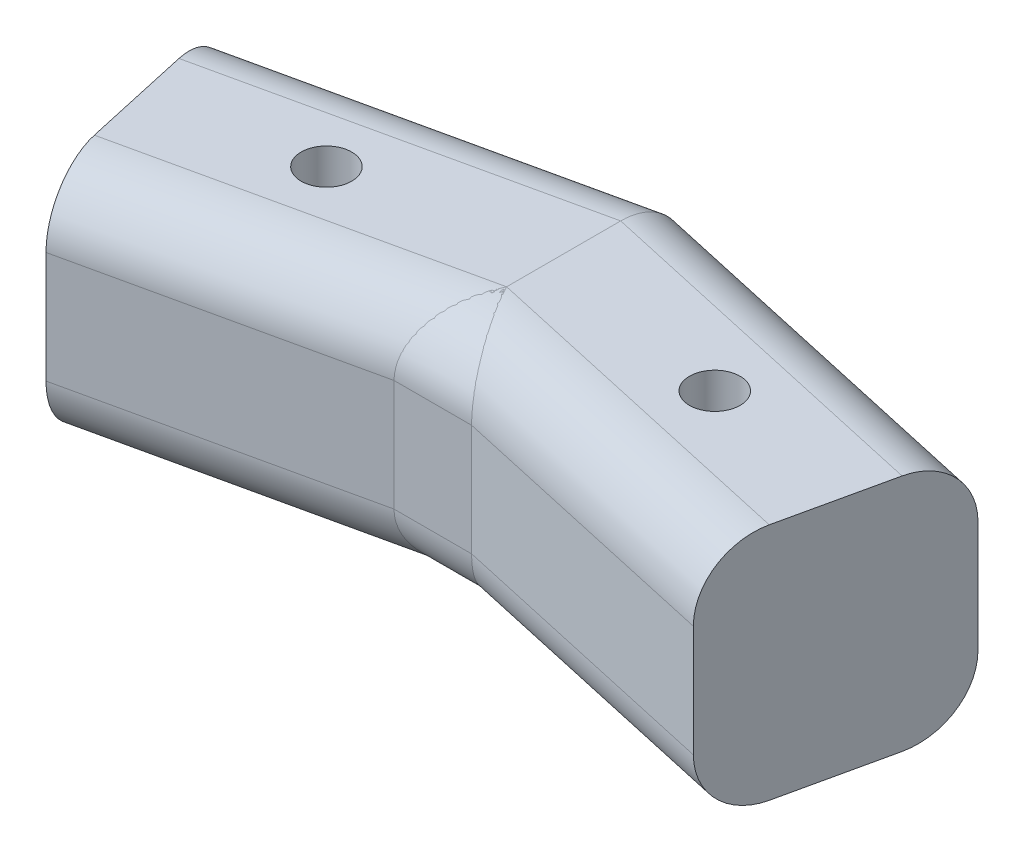
ISO-10303-21;
HEADER;
FILE_DESCRIPTION(('STEP AP214'),'2;1');
FILE_NAME('part.step','',(''),(''),'','','');
FILE_SCHEMA(('AUTOMOTIVE_DESIGN { 1 0 10303 214 1 1 1 1 }'));
ENDSEC;
DATA;
#1=APPLICATION_CONTEXT('core data for automotive mechanical design processes');
#2=APPLICATION_PROTOCOL_DEFINITION('international standard','automotive_design',2000,#1);
#3=PRODUCT_CONTEXT('',#1,'mechanical');
#4=PRODUCT('Part','Part','',(#3));
#5=PRODUCT_RELATED_PRODUCT_CATEGORY('part','',(#4));
#6=PRODUCT_DEFINITION_FORMATION('','',#4);
#7=PRODUCT_DEFINITION_CONTEXT('part definition',#1,'design');
#8=PRODUCT_DEFINITION('design','',#6,#7);
#9=PRODUCT_DEFINITION_SHAPE('','',#8);
#10=(LENGTH_UNIT() NAMED_UNIT(*) SI_UNIT(.MILLI.,.METRE.));
#11=(NAMED_UNIT(*) PLANE_ANGLE_UNIT() SI_UNIT($,.RADIAN.));
#12=(NAMED_UNIT(*) SI_UNIT($,.STERADIAN.) SOLID_ANGLE_UNIT());
#13=UNCERTAINTY_MEASURE_WITH_UNIT(LENGTH_MEASURE(1.E-05),#10,'distance_accuracy_value','');
#14=(GEOMETRIC_REPRESENTATION_CONTEXT(3) GLOBAL_UNCERTAINTY_ASSIGNED_CONTEXT((#13)) GLOBAL_UNIT_ASSIGNED_CONTEXT((#10,
#11,#12)) REPRESENTATION_CONTEXT('',''));
#15=CARTESIAN_POINT('',(0.,0.,0.));
#16=DIRECTION('',(0.,0.,1.));
#17=DIRECTION('',(1.,0.,0.));
#18=AXIS2_PLACEMENT_3D('',#15,#16,#17);
#19=CARTESIAN_POINT('',(0.,-9.525,4.55292244112799));
#20=CARTESIAN_POINT('',(-0.405791092922876,-9.52535412938452,5.32406036212419));
#21=CARTESIAN_POINT('',(-0.811316954403451,-9.39280386113973,6.09469425524347));
#22=CARTESIAN_POINT('',(-1.56112119510349,-8.88381218917494,7.5195714726382));
#23=CARTESIAN_POINT('',(-1.90490937707828,-8.50734945434817,8.17288325925607));
#24=CARTESIAN_POINT('',(-2.47878471987863,-7.56685544250716,9.26343710944152));
#25=CARTESIAN_POINT('',(-2.7084966189939,-7.00343920013842,9.69996605105997));
#26=CARTESIAN_POINT('',(-3.01907573743721,-5.7746244726909,10.2901695815911));
#27=CARTESIAN_POINT('',(-3.09995590704577,-5.1100296057156,10.4438687803402));
#28=CARTESIAN_POINT('',(-3.09973982260569,-4.445,10.4434581480992));
#29=CARTESIAN_POINT('',(0.,-9.525,4.55292244112802));
#30=CARTESIAN_POINT('',(0.405791092922976,-9.52535412938452,5.32406036212419));
#31=CARTESIAN_POINT('',(0.811316954403549,-9.39280386113972,6.09469425524349));
#32=CARTESIAN_POINT('',(1.56112119510361,-8.88381218917493,7.51957147263821));
#33=CARTESIAN_POINT('',(1.90490937707838,-8.50734945434815,8.17288325925609));
#34=CARTESIAN_POINT('',(2.47878471987874,-7.56685544250715,9.26343710944152));
#35=CARTESIAN_POINT('',(2.70849661899401,-7.00343920013841,9.69996605105997));
#36=CARTESIAN_POINT('',(3.01907573743732,-5.77462447269089,10.2901695815911));
#37=CARTESIAN_POINT('',(3.09995590704586,-5.1100296057156,10.4438687803402));
#38=CARTESIAN_POINT('',(3.0997398226058,-4.445,10.4434581480992));
#39=B_SPLINE_SURFACE_WITH_KNOTS('',1,3,((#19,#20,#21,#22,#23,#24,#25,#26,#27,#28),(#29,#30,#31,
#32,#33,#34,#35,#36,#37,#38)),.UNSPECIFIED.,.F.,.F.,.F.,(2,2),(4,2,2,2,4),(0.,1.),(0.,
0.392699081698724,0.785398163397448,1.17809724509617,1.57079632679489),.UNSPECIFIED.);
#40=CARTESIAN_POINT('',(-3.09973982260569,-4.445,10.4434581480992));
#41=CARTESIAN_POINT('',(-3.09995590704577,-5.1100296057156,10.4438687803402));
#42=CARTESIAN_POINT('',(-3.01907573743721,-5.7746244726909,10.2901695815911));
#43=CARTESIAN_POINT('',(-2.7084966189939,-7.00343920013842,9.69996605105997));
#44=CARTESIAN_POINT('',(-2.47878471987863,-7.56685544250716,9.26343710944152));
#45=CARTESIAN_POINT('',(-1.90490937707828,-8.50734945434817,8.17288325925607));
#46=CARTESIAN_POINT('',(-1.56112119510349,-8.88381218917494,7.5195714726382));
#47=CARTESIAN_POINT('',(-0.811316954403451,-9.39280386113973,6.09469425524347));
#48=CARTESIAN_POINT('',(-0.405791092922876,-9.52535412938452,5.32406036212419));
#49=CARTESIAN_POINT('',(0.,-9.525,4.55292244112799));
#50=B_SPLINE_CURVE_WITH_KNOTS('',3,(#40,#41,#42,#43,#44,#45,#46,#47,#48,#49),.UNSPECIFIED.,.F.,
.F.,(4,2,2,2,4),(0.,0.392699081698724,0.785398163397448,1.17809724509617,1.57079632679489),.UNSPECIFIED.);
#51=CARTESIAN_POINT('',(0.,-9.525,4.552922441128));
#52=VERTEX_POINT('',#51);
#53=CARTESIAN_POINT('',(-3.09973982260576,-4.445,10.4434581480992));
#54=VERTEX_POINT('',#53);
#55=EDGE_CURVE('E76',#52,#54,#50,.F.);
#56=CARTESIAN_POINT('',(0.,-9.525,4.55292244112802));
#57=CARTESIAN_POINT('',(0.405791092922976,-9.52535412938452,5.32406036212419));
#58=CARTESIAN_POINT('',(0.811316954403549,-9.39280386113972,6.09469425524349));
#59=CARTESIAN_POINT('',(1.56112119510361,-8.88381218917493,7.51957147263821));
#60=CARTESIAN_POINT('',(1.90490937707838,-8.50734945434815,8.17288325925609));
#61=CARTESIAN_POINT('',(2.47878471987874,-7.56685544250715,9.26343710944152));
#62=CARTESIAN_POINT('',(2.70849661899401,-7.00343920013841,9.69996605105997));
#63=CARTESIAN_POINT('',(3.01907573743732,-5.77462447269089,10.2901695815911));
#64=CARTESIAN_POINT('',(3.09995590704586,-5.1100296057156,10.4438687803402));
#65=CARTESIAN_POINT('',(3.0997398226058,-4.445,10.4434581480992));
#66=B_SPLINE_CURVE_WITH_KNOTS('',3,(#56,#57,#58,#59,#60,#61,#62,#63,#64,#65),.UNSPECIFIED.,.F.,
.F.,(4,2,2,2,4),(0.,0.392699081698724,0.785398163397448,1.17809724509617,1.57079632679489),.UNSPECIFIED.);
#67=CARTESIAN_POINT('',(3.09973982260572,-4.445,10.4434581480991));
#68=VERTEX_POINT('',#67);
#69=EDGE_CURVE('E96',#68,#52,#66,.F.);
#70=CARTESIAN_POINT('',(3.0997398226058,-4.445,10.4434581480992));
#71=CARTESIAN_POINT('',(-3.09973982260569,-4.445,10.4434581480992));
#72=B_SPLINE_CURVE_WITH_KNOTS('',1,(#70,#71),.UNSPECIFIED.,.F.,.F.,(2,2),(0.,1.),.UNSPECIFIED.);
#73=EDGE_CURVE('E114',#54,#68,#72,.F.);
#74=ORIENTED_EDGE('',*,*,#55,.F.);
#75=ORIENTED_EDGE('',*,*,#69,.F.);
#76=ORIENTED_EDGE('',*,*,#73,.F.);
#77=EDGE_LOOP('',(#74,#75,#76));
#78=FACE_BOUND('',#77,.T.);
#79=ADVANCED_FACE('F48',(#78),#39,.T.);
#80=CARTESIAN_POINT('',(3.09973982260571,-9.525,10.4434581480991));
#81=DIRECTION('',(0.,0.,1.));
#82=DIRECTION('',(0.,1.,0.));
#83=AXIS2_PLACEMENT_3D('',#80,#81,#82);
#84=PLANE('',#83);
#85=ORIENTED_EDGE('',*,*,#73,.T.);
#86=DIRECTION('',(0.,-1.,0.));
#87=VECTOR('',#86,1.);
#88=CARTESIAN_POINT('',(3.09973982260571,-4.445,10.4434581480991));
#89=LINE('',#88,#87);
#90=CARTESIAN_POINT('',(3.09973982260583,4.445,10.4434581480992));
#91=VERTEX_POINT('',#90);
#92=EDGE_CURVE('E60',#91,#68,#89,.T.);
#93=ORIENTED_EDGE('',*,*,#92,.F.);
#94=CARTESIAN_POINT('',(-3.09973982260569,4.44499999999999,10.4434581480992));
#95=CARTESIAN_POINT('',(3.0997398226058,4.445,10.4434581480992));
#96=B_SPLINE_CURVE_WITH_KNOTS('',1,(#94,#95),.UNSPECIFIED.,.F.,.F.,(2,2),(0.,1.),.UNSPECIFIED.);
#97=CARTESIAN_POINT('',(-3.09973982260569,4.44499999999999,10.4434581480991));
#98=VERTEX_POINT('',#97);
#99=EDGE_CURVE('E187',#98,#91,#96,.T.);
#100=ORIENTED_EDGE('',*,*,#99,.F.);
#101=DIRECTION('',(0.,1.,0.));
#102=VECTOR('',#101,1.);
#103=CARTESIAN_POINT('',(-3.09973982260576,4.445,10.4434581480992));
#104=LINE('',#103,#102);
#105=EDGE_CURVE('E12',#54,#98,#104,.T.);
#106=ORIENTED_EDGE('',*,*,#105,.F.);
#107=EDGE_LOOP('',(#85,#93,#100,#106));
#108=FACE_BOUND('',#107,.T.);
#109=ADVANCED_FACE('F138',(#108),#84,.T.);
#110=CARTESIAN_POINT('',(-3.09973982260569,4.44499999999999,10.4434581480992));
#111=CARTESIAN_POINT('',(-3.09995590704578,5.11002960571559,10.4438687803402));
#112=CARTESIAN_POINT('',(-3.01907573743721,5.77462447269088,10.2901695815911));
#113=CARTESIAN_POINT('',(-2.70849661899391,7.00343920013841,9.69996605105997));
#114=CARTESIAN_POINT('',(-2.47878471987864,7.56685544250713,9.26343710944154));
#115=CARTESIAN_POINT('',(-1.90490937707828,8.50734945434817,8.17288325925607));
#116=CARTESIAN_POINT('',(-1.5611211951035,8.88381218917493,7.51957147263821));
#117=CARTESIAN_POINT('',(-0.811316954403441,9.39280386113974,6.09469425524345));
#118=CARTESIAN_POINT('',(-0.405791092922873,9.52535412938453,5.32406036212417));
#119=CARTESIAN_POINT('',(0.,9.525,4.55292244112798));
#120=CARTESIAN_POINT('',(3.0997398226058,4.445,10.4434581480992));
#121=CARTESIAN_POINT('',(3.09995590704586,5.11002960571559,10.4438687803402));
#122=CARTESIAN_POINT('',(3.01907573743732,5.77462447269089,10.2901695815911));
#123=CARTESIAN_POINT('',(2.708496618994,7.00343920013841,9.69996605105997));
#124=CARTESIAN_POINT('',(2.47878471987875,7.56685544250713,9.26343710944154));
#125=CARTESIAN_POINT('',(1.90490937707838,8.50734945434816,8.17288325925608));
#126=CARTESIAN_POINT('',(1.56112119510362,8.88381218917492,7.51957147263822));
#127=CARTESIAN_POINT('',(0.811316954403538,9.39280386113973,6.09469425524347));
#128=CARTESIAN_POINT('',(0.405791092922976,9.52535412938452,5.32406036212419));
#129=CARTESIAN_POINT('',(0.,9.525,4.55292244112799));
#130=B_SPLINE_SURFACE_WITH_KNOTS('',1,3,((#110,#111,#112,#113,#114,#115,#116,#117,#118,#119),
(#120,#121,#122,#123,#124,#125,#126,#127,#128,#129)),.UNSPECIFIED.,.F.,.F.,.F.,(2,2),(4,2,2,2,
4),(0.,1.),(4.71238898038469,5.10508806208341,5.49778714378214,5.89048622548086,
6.28318530717959),.UNSPECIFIED.);
#131=CARTESIAN_POINT('',(3.0997398226058,4.445,10.4434581480992));
#132=CARTESIAN_POINT('',(3.09995590704586,5.11002960571559,10.4438687803402));
#133=CARTESIAN_POINT('',(3.01907573743732,5.77462447269089,10.2901695815911));
#134=CARTESIAN_POINT('',(2.708496618994,7.00343920013841,9.69996605105997));
#135=CARTESIAN_POINT('',(2.47878471987875,7.56685544250713,9.26343710944154));
#136=CARTESIAN_POINT('',(1.90490937707838,8.50734945434816,8.17288325925608));
#137=CARTESIAN_POINT('',(1.56112119510362,8.88381218917492,7.51957147263822));
#138=CARTESIAN_POINT('',(0.811316954403538,9.39280386113973,6.09469425524347));
#139=CARTESIAN_POINT('',(0.405791092922976,9.52535412938452,5.32406036212419));
#140=CARTESIAN_POINT('',(0.,9.525,4.55292244112799));
#141=B_SPLINE_CURVE_WITH_KNOTS('',3,(#131,#132,#133,#134,#135,#136,#137,#138,#139,#140),
.UNSPECIFIED.,.F.,.F.,(4,2,2,2,4),(4.71238898038469,5.10508806208341,5.49778714378214,
5.89048622548086,6.28318530717959),.UNSPECIFIED.);
#142=CARTESIAN_POINT('',(0.,9.525,4.55292244112798));
#143=VERTEX_POINT('',#142);
#144=EDGE_CURVE('E171',#143,#91,#141,.F.);
#145=CARTESIAN_POINT('',(0.,9.525,4.55292244112798));
#146=CARTESIAN_POINT('',(-0.405791092922873,9.52535412938453,5.32406036212417));
#147=CARTESIAN_POINT('',(-0.811316954403441,9.39280386113974,6.09469425524345));
#148=CARTESIAN_POINT('',(-1.5611211951035,8.88381218917493,7.51957147263821));
#149=CARTESIAN_POINT('',(-1.90490937707828,8.50734945434817,8.17288325925607));
#150=CARTESIAN_POINT('',(-2.47878471987864,7.56685544250713,9.26343710944154));
#151=CARTESIAN_POINT('',(-2.70849661899391,7.00343920013841,9.69996605105997));
#152=CARTESIAN_POINT('',(-3.01907573743721,5.77462447269088,10.2901695815911));
#153=CARTESIAN_POINT('',(-3.09995590704578,5.11002960571559,10.4438687803402));
#154=CARTESIAN_POINT('',(-3.09973982260569,4.44499999999999,10.4434581480992));
#155=B_SPLINE_CURVE_WITH_KNOTS('',3,(#145,#146,#147,#148,#149,#150,#151,#152,#153,#154),
.UNSPECIFIED.,.F.,.F.,(4,2,2,2,4),(4.71238898038469,5.10508806208341,5.49778714378214,
5.89048622548086,6.28318530717959),.UNSPECIFIED.);
#156=EDGE_CURVE('E106',#98,#143,#155,.F.);
#157=ORIENTED_EDGE('',*,*,#144,.F.);
#158=ORIENTED_EDGE('',*,*,#156,.F.);
#159=ORIENTED_EDGE('',*,*,#99,.T.);
#160=EDGE_LOOP('',(#157,#158,#159));
#161=FACE_BOUND('',#160,.T.);
#162=ADVANCED_FACE('F147',(#161),#130,.T.);
#163=CARTESIAN_POINT('',(28.6830537952354,-9.525,3.39738243914178));
#164=DIRECTION('',(0.2164396139381,0.,0.976296007119934));
#165=DIRECTION('',(0.976296007119934,0.,-0.2164396139381));
#166=AXIS2_PLACEMENT_3D('',#163,#164,#165);
#167=PLANE('',#166);
#168=DIRECTION('',(0.976296007119934,0.,-0.2164396139381));
#169=VECTOR('',#168,1.);
#170=CARTESIAN_POINT('',(28.6830537952354,4.44499999999999,3.39738243914178));
#171=LINE('',#170,#169);
#172=CARTESIAN_POINT('',(0.,4.445,9.75626237384569));
#173=VERTEX_POINT('',#172);
#174=EDGE_CURVE('E111',#173,#98,#171,.F.);
#175=ORIENTED_EDGE('',*,*,#174,.F.);
#176=DIRECTION('',(0.,-1.,0.));
#177=VECTOR('',#176,1.);
#178=CARTESIAN_POINT('',(0.,-9.525,9.75626237384569));
#179=LINE('',#178,#177);
#180=CARTESIAN_POINT('',(0.,-4.445,9.7562623738457));
#181=VERTEX_POINT('',#180);
#182=EDGE_CURVE('E207',#173,#181,#179,.T.);
#183=ORIENTED_EDGE('',*,*,#182,.T.);
#184=DIRECTION('',(0.976296007119934,0.,-0.2164396139381));
#185=VECTOR('',#184,1.);
#186=CARTESIAN_POINT('',(28.6830537952354,-4.445,3.39738243914178));
#187=LINE('',#186,#185);
#188=EDGE_CURVE('E110',#54,#181,#187,.T.);
#189=ORIENTED_EDGE('',*,*,#188,.F.);
#190=ORIENTED_EDGE('',*,*,#105,.T.);
#191=EDGE_LOOP('',(#175,#183,#189,#190));
#192=FACE_BOUND('',#191,.T.);
#193=ADVANCED_FACE('F230',(#192),#167,.F.);
#194=CARTESIAN_POINT('',(27.5835405564298,-4.445,-1.56220127702748));
#195=DIRECTION('',(-0.976296007119934,0.,0.2164396139381));
#196=DIRECTION('',(0.2164396139381,0.,0.976296007119934));
#197=AXIS2_PLACEMENT_3D('',#194,#195,#196);
#198=CYLINDRICAL_SURFACE('',#197,5.08);
#199=ORIENTED_EDGE('',*,*,#188,.T.);
#200=CARTESIAN_POINT('',(0.,-4.445,4.55292244112799));
#201=DIRECTION('',(-1.,0.,0.));
#202=DIRECTION('',(0.,0.,1.));
#203=AXIS2_PLACEMENT_3D('',#200,#201,#202);
#204=ELLIPSE('',#203,5.2033399327177,5.08);
#205=EDGE_CURVE('E99',#181,#52,#204,.F.);
#206=ORIENTED_EDGE('',*,*,#205,.T.);
#207=ORIENTED_EDGE('',*,*,#55,.T.);
#208=EDGE_LOOP('',(#199,#206,#207));
#209=FACE_BOUND('',#208,.T.);
#210=ADVANCED_FACE('F109',(#209),#198,.F.);
#211=CARTESIAN_POINT('',(-27.5835405564298,-4.445,-1.56220127702747));
#212=DIRECTION('',(0.976296007119934,0.,0.2164396139381));
#213=DIRECTION('',(0.2164396139381,0.,-0.976296007119934));
#214=AXIS2_PLACEMENT_3D('',#211,#212,#213);
#215=CYLINDRICAL_SURFACE('',#214,5.08);
#216=ORIENTED_EDGE('',*,*,#205,.F.);
#217=DIRECTION('',(0.976296007119934,0.,0.2164396139381));
#218=VECTOR('',#217,1.);
#219=CARTESIAN_POINT('',(-28.6830537952354,-4.445,3.39738243914179));
#220=LINE('',#219,#218);
#221=EDGE_CURVE('E102',#181,#68,#220,.T.);
#222=ORIENTED_EDGE('',*,*,#221,.T.);
#223=ORIENTED_EDGE('',*,*,#69,.T.);
#224=EDGE_LOOP('',(#216,#222,#223));
#225=FACE_BOUND('',#224,.T.);
#226=ADVANCED_FACE('F98',(#225),#215,.F.);
#227=CARTESIAN_POINT('',(-28.6830537952354,-9.525,3.39738243914179));
#228=DIRECTION('',(-0.2164396139381,0.,0.976296007119934));
#229=DIRECTION('',(0.976296007119934,0.,0.2164396139381));
#230=AXIS2_PLACEMENT_3D('',#227,#228,#229);
#231=PLANE('',#230);
#232=ORIENTED_EDGE('',*,*,#221,.F.);
#233=ORIENTED_EDGE('',*,*,#182,.F.);
#234=DIRECTION('',(0.976296007119934,0.,0.2164396139381));
#235=VECTOR('',#234,1.);
#236=CARTESIAN_POINT('',(-28.6830537952354,4.445,3.39738243914179));
#237=LINE('',#236,#235);
#238=EDGE_CURVE('E317',#91,#173,#237,.F.);
#239=ORIENTED_EDGE('',*,*,#238,.F.);
#240=ORIENTED_EDGE('',*,*,#92,.T.);
#241=EDGE_LOOP('',(#232,#233,#239,#240));
#242=FACE_BOUND('',#241,.T.);
#243=ADVANCED_FACE('F236',(#242),#231,.F.);
#244=CARTESIAN_POINT('',(27.5835405564298,4.445,-1.56220127702748));
#245=DIRECTION('',(-0.976296007119934,0.,0.2164396139381));
#246=DIRECTION('',(0.2164396139381,0.,0.976296007119934));
#247=AXIS2_PLACEMENT_3D('',#244,#245,#246);
#248=CYLINDRICAL_SURFACE('',#247,5.08);
#249=CARTESIAN_POINT('',(0.,4.445,4.55292244112799));
#250=DIRECTION('',(-1.,0.,0.));
#251=DIRECTION('',(0.,0.,1.));
#252=AXIS2_PLACEMENT_3D('',#249,#250,#251);
#253=ELLIPSE('',#252,5.2033399327177,5.08);
#254=EDGE_CURVE('E68',#143,#173,#253,.F.);
#255=ORIENTED_EDGE('',*,*,#254,.T.);
#256=ORIENTED_EDGE('',*,*,#174,.T.);
#257=ORIENTED_EDGE('',*,*,#156,.T.);
#258=EDGE_LOOP('',(#255,#256,#257));
#259=FACE_BOUND('',#258,.T.);
#260=ADVANCED_FACE('F231',(#259),#248,.F.);
#261=CARTESIAN_POINT('',(-27.5835405564298,4.445,-1.56220127702747));
#262=DIRECTION('',(0.976296007119934,0.,0.2164396139381));
#263=DIRECTION('',(0.2164396139381,0.,-0.976296007119934));
#264=AXIS2_PLACEMENT_3D('',#261,#262,#263);
#265=CYLINDRICAL_SURFACE('',#264,5.08);
#266=ORIENTED_EDGE('',*,*,#238,.T.);
#267=ORIENTED_EDGE('',*,*,#254,.F.);
#268=ORIENTED_EDGE('',*,*,#144,.T.);
#269=EDGE_LOOP('',(#266,#267,#268));
#270=FACE_BOUND('',#269,.T.);
#271=ADVANCED_FACE('F237',(#270),#265,.F.);
#272=CLOSED_SHELL('',(#79,#109,#162,#193,#210,#226,#243,#260,#271));
#273=MANIFOLD_SOLID_BREP('B2',#272);
#274=CARTESIAN_POINT('',(0.,0.,0.));
#275=DIRECTION('',(1.,0.,0.));
#276=DIRECTION('',(0.,0.,-1.));
#277=AXIS2_PLACEMENT_3D('',#274,#275,#276);
#278=PLANE('',#277);
#279=DIRECTION('',(0.,0.,-1.));
#280=VECTOR('',#279,1.);
#281=CARTESIAN_POINT('',(0.,9.525,3.39738243914178));
#282=LINE('',#281,#280);
#283=CARTESIAN_POINT('',(0.,9.525,4.55292244112799));
#284=VERTEX_POINT('',#283);
#285=CARTESIAN_POINT('',(0.,9.525,-4.55292244112799));
#286=VERTEX_POINT('',#285);
#287=EDGE_CURVE('E453',#284,#286,#282,.T.);
#288=ORIENTED_EDGE('',*,*,#287,.F.);
#289=CARTESIAN_POINT('',(0.,4.445,4.55292244112799));
#290=DIRECTION('',(1.,0.,0.));
#291=DIRECTION('',(0.,0.,1.));
#292=AXIS2_PLACEMENT_3D('',#289,#290,#291);
#293=ELLIPSE('',#292,5.2033399327177,5.08);
#294=CARTESIAN_POINT('',(0.,4.44499999999999,9.75626237384569));
#295=VERTEX_POINT('',#294);
#296=EDGE_CURVE('E452',#284,#295,#293,.T.);
#297=ORIENTED_EDGE('',*,*,#296,.T.);
#298=DIRECTION('',(0.,1.,0.));
#299=VECTOR('',#298,1.);
#300=CARTESIAN_POINT('',(0.,-9.525,9.75626237384569));
#301=LINE('',#300,#299);
#302=CARTESIAN_POINT('',(0.,-4.445,9.75626237384569));
#303=VERTEX_POINT('',#302);
#304=EDGE_CURVE('E442',#303,#295,#301,.T.);
#305=ORIENTED_EDGE('',*,*,#304,.F.);
#306=CARTESIAN_POINT('',(0.,-4.445,4.55292244112799));
#307=DIRECTION('',(1.,0.,0.));
#308=DIRECTION('',(0.,0.,1.));
#309=AXIS2_PLACEMENT_3D('',#306,#307,#308);
#310=ELLIPSE('',#309,5.2033399327177,5.08);
#311=CARTESIAN_POINT('',(0.,-9.525,4.55292244112799));
#312=VERTEX_POINT('',#311);
#313=EDGE_CURVE('E388',#303,#312,#310,.T.);
#314=ORIENTED_EDGE('',*,*,#313,.T.);
#315=DIRECTION('',(0.,0.,1.));
#316=VECTOR('',#315,1.);
#317=CARTESIAN_POINT('',(0.,-9.525,3.39738243914178));
#318=LINE('',#317,#316);
#319=CARTESIAN_POINT('',(0.,-9.525,-4.55292244112799));
#320=VERTEX_POINT('',#319);
#321=EDGE_CURVE('E454',#320,#312,#318,.T.);
#322=ORIENTED_EDGE('',*,*,#321,.F.);
#323=CARTESIAN_POINT('',(0.,-4.445,-4.55292244112799));
#324=DIRECTION('',(1.,0.,0.));
#325=DIRECTION('',(0.,0.,1.));
#326=AXIS2_PLACEMENT_3D('',#323,#324,#325);
#327=ELLIPSE('',#326,5.2033399327177,5.08);
#328=CARTESIAN_POINT('',(0.,-4.445,-9.7562623738457));
#329=VERTEX_POINT('',#328);
#330=EDGE_CURVE('E458',#320,#329,#327,.T.);
#331=ORIENTED_EDGE('',*,*,#330,.T.);
#332=DIRECTION('',(0.,-1.,0.));
#333=VECTOR('',#332,1.);
#334=CARTESIAN_POINT('',(0.,-9.525,-9.7562623738457));
#335=LINE('',#334,#333);
#336=CARTESIAN_POINT('',(0.,4.44499999999999,-9.7562623738457));
#337=VERTEX_POINT('',#336);
#338=EDGE_CURVE('E448',#337,#329,#335,.T.);
#339=ORIENTED_EDGE('',*,*,#338,.F.);
#340=CARTESIAN_POINT('',(0.,4.445,-4.55292244112799));
#341=DIRECTION('',(1.,0.,0.));
#342=DIRECTION('',(0.,0.,1.));
#343=AXIS2_PLACEMENT_3D('',#340,#341,#342);
#344=ELLIPSE('',#343,5.2033399327177,5.08);
#345=EDGE_CURVE('E461',#337,#286,#344,.T.);
#346=ORIENTED_EDGE('',*,*,#345,.T.);
#347=EDGE_LOOP('',(#288,#297,#305,#314,#322,#331,#339,#346));
#348=FACE_BOUND('',#347,.T.);
#349=ADVANCED_FACE('F373',(#348),#278,.T.);
#350=CARTESIAN_POINT('',(-27.8976584034521,0.,6.18476196828121));
#351=DIRECTION('',(-0.976296007119934,0.,0.2164396139381));
#352=DIRECTION('',(0.2164396139381,0.,0.976296007119934));
#353=AXIS2_PLACEMENT_3D('',#350,#351,#352);
#354=PLANE('',#353);
#355=DIRECTION('',(0.,1.,0.));
#356=VECTOR('',#355,1.);
#357=CARTESIAN_POINT('',(-25.8360710806917,-9.525,15.4839814360986));
#358=LINE('',#357,#356);
#359=CARTESIAN_POINT('',(-25.8360710806917,-4.445,15.4839814360986));
#360=VERTEX_POINT('',#359);
#361=CARTESIAN_POINT('',(-25.8360710806917,4.445,15.4839814360986));
#362=VERTEX_POINT('',#361);
#363=EDGE_CURVE('E445',#360,#362,#358,.T.);
#364=ORIENTED_EDGE('',*,*,#363,.T.);
#365=CARTESIAN_POINT('',(-26.9355843194973,4.44499999999999,10.5243977199293));
#366=DIRECTION('',(-0.976296007119934,0.,0.2164396139381));
#367=DIRECTION('',(0.2164396139381,0.,0.976296007119934));
#368=AXIS2_PLACEMENT_3D('',#365,#366,#367);
#369=CIRCLE('',#368,5.08);
#370=CARTESIAN_POINT('',(-26.9355843194973,9.525,10.5243977199293));
#371=VERTEX_POINT('',#370);
#372=EDGE_CURVE('E499',#362,#371,#369,.T.);
#373=ORIENTED_EDGE('',*,*,#372,.T.);
#374=DIRECTION('',(-0.2164396139381,0.,-0.976296007119934));
#375=VECTOR('',#374,1.);
#376=CARTESIAN_POINT('',(-25.8360710806917,9.525,15.4839814360986));
#377=LINE('',#376,#375);
#378=CARTESIAN_POINT('',(-28.859732487407,9.525,1.8451262166331));
#379=VERTEX_POINT('',#378);
#380=EDGE_CURVE('E483',#371,#379,#377,.T.);
#381=ORIENTED_EDGE('',*,*,#380,.T.);
#382=CARTESIAN_POINT('',(-28.859732487407,4.445,1.8451262166331));
#383=DIRECTION('',(-0.976296007119934,0.,0.2164396139381));
#384=DIRECTION('',(0.2164396139381,0.,0.976296007119934));
#385=AXIS2_PLACEMENT_3D('',#382,#383,#384);
#386=CIRCLE('',#385,5.08);
#387=CARTESIAN_POINT('',(-29.9592457262125,4.44499999999999,-3.11445749953617));
#388=VERTEX_POINT('',#387);
#389=EDGE_CURVE('E497',#379,#388,#386,.T.);
#390=ORIENTED_EDGE('',*,*,#389,.T.);
#391=DIRECTION('',(0.,-1.,0.));
#392=VECTOR('',#391,1.);
#393=CARTESIAN_POINT('',(-29.9592457262125,-9.525,-3.11445749953617));
#394=LINE('',#393,#392);
#395=CARTESIAN_POINT('',(-29.9592457262125,-4.445,-3.11445749953617));
#396=VERTEX_POINT('',#395);
#397=EDGE_CURVE('E481',#388,#396,#394,.T.);
#398=ORIENTED_EDGE('',*,*,#397,.T.);
#399=CARTESIAN_POINT('',(-28.859732487407,-4.445,1.8451262166331));
#400=DIRECTION('',(-0.976296007119934,0.,0.2164396139381));
#401=DIRECTION('',(0.2164396139381,0.,0.976296007119934));
#402=AXIS2_PLACEMENT_3D('',#399,#400,#401);
#403=CIRCLE('',#402,5.08);
#404=CARTESIAN_POINT('',(-28.859732487407,-9.525,1.8451262166331));
#405=VERTEX_POINT('',#404);
#406=EDGE_CURVE('E480',#396,#405,#403,.T.);
#407=ORIENTED_EDGE('',*,*,#406,.T.);
#408=DIRECTION('',(0.2164396139381,0.,0.976296007119934));
#409=VECTOR('',#408,1.);
#410=CARTESIAN_POINT('',(-25.8360710806917,-9.525,15.4839814360986));
#411=LINE('',#410,#409);
#412=CARTESIAN_POINT('',(-26.9355843194973,-9.525,10.5243977199293));
#413=VERTEX_POINT('',#412);
#414=EDGE_CURVE('E475',#405,#413,#411,.T.);
#415=ORIENTED_EDGE('',*,*,#414,.T.);
#416=CARTESIAN_POINT('',(-26.9355843194973,-4.445,10.5243977199293));
#417=DIRECTION('',(-0.976296007119934,0.,0.2164396139381));
#418=DIRECTION('',(0.2164396139381,0.,0.976296007119934));
#419=AXIS2_PLACEMENT_3D('',#416,#417,#418);
#420=CIRCLE('',#419,5.08);
#421=EDGE_CURVE('E478',#413,#360,#420,.T.);
#422=ORIENTED_EDGE('',*,*,#421,.T.);
#423=EDGE_LOOP('',(#364,#373,#381,#390,#398,#407,#415,#422));
#424=FACE_BOUND('',#423,.T.);
#425=ADVANCED_FACE('F477',(#424),#354,.T.);
#426=CARTESIAN_POINT('',(28.6830537952354,-9.525,3.39738243914178));
#427=DIRECTION('',(0.,-1.,0.));
#428=DIRECTION('',(0.,0.,-1.));
#429=AXIS2_PLACEMENT_3D('',#426,#427,#428);
#430=PLANE('',#429);
#431=CARTESIAN_POINT('',(-15.498699113029,-9.52500000000001,3.43597887126733));
#432=DIRECTION('',(0.,1.,0.));
#433=DIRECTION('',(0.,0.,1.));
#434=AXIS2_PLACEMENT_3D('',#431,#432,#433);
#435=CIRCLE('',#434,2.01929999999999);
#436=CARTESIAN_POINT('',(-15.498699113029,-9.52500000000001,5.45527887126733));
#437=VERTEX_POINT('',#436);
#438=EDGE_CURVE('E485',#437,#437,#435,.T.);
#439=ORIENTED_EDGE('',*,*,#438,.T.);
#440=EDGE_LOOP('',(#439));
#441=FACE_BOUND('',#440,.T.);
#442=ORIENTED_EDGE('',*,*,#414,.F.);
#443=DIRECTION('',(-0.976296007119934,0.,0.2164396139381));
#444=VECTOR('',#443,1.);
#445=CARTESIAN_POINT('',(25.6593923885201,-9.525,-10.2414727803237));
#446=LINE('',#445,#444);
#447=EDGE_CURVE('E46',#405,#320,#446,.F.);
#448=ORIENTED_EDGE('',*,*,#447,.T.);
#449=ORIENTED_EDGE('',*,*,#321,.T.);
#450=DIRECTION('',(-0.976296007119934,0.,0.2164396139381));
#451=VECTOR('',#450,1.);
#452=CARTESIAN_POINT('',(27.5835405564298,-9.525,-1.56220127702749));
#453=LINE('',#452,#451);
#454=EDGE_CURVE('E381',#312,#413,#453,.T.);
#455=ORIENTED_EDGE('',*,*,#454,.T.);
#456=EDGE_LOOP('',(#442,#448,#449,#455));
#457=FACE_BOUND('',#456,.T.);
#458=ADVANCED_FACE('F474',(#441,#457),#430,.T.);
#459=CARTESIAN_POINT('',(28.6830537952354,-9.525,3.39738243914178));
#460=DIRECTION('',(0.2164396139381,0.,0.976296007119934));
#461=DIRECTION('',(0.976296007119934,0.,-0.2164396139381));
#462=AXIS2_PLACEMENT_3D('',#459,#460,#461);
#463=PLANE('',#462);
#464=ORIENTED_EDGE('',*,*,#304,.T.);
#465=DIRECTION('',(-0.976296007119934,0.,0.2164396139381));
#466=VECTOR('',#465,1.);
#467=CARTESIAN_POINT('',(28.6830537952354,4.445,3.39738243914178));
#468=LINE('',#467,#466);
#469=EDGE_CURVE('E447',#295,#362,#468,.T.);
#470=ORIENTED_EDGE('',*,*,#469,.T.);
#471=ORIENTED_EDGE('',*,*,#363,.F.);
#472=DIRECTION('',(-0.976296007119934,0.,0.2164396139381));
#473=VECTOR('',#472,1.);
#474=CARTESIAN_POINT('',(28.6830537952354,-4.445,3.39738243914178));
#475=LINE('',#474,#473);
#476=EDGE_CURVE('E439',#360,#303,#475,.F.);
#477=ORIENTED_EDGE('',*,*,#476,.T.);
#478=EDGE_LOOP('',(#464,#470,#471,#477));
#479=FACE_BOUND('',#478,.T.);
#480=ADVANCED_FACE('F440',(#479),#463,.T.);
#481=CARTESIAN_POINT('',(28.6830537952354,9.525,3.39738243914178));
#482=DIRECTION('',(0.,1.,0.));
#483=DIRECTION('',(0.,0.,1.));
#484=AXIS2_PLACEMENT_3D('',#481,#482,#483);
#485=PLANE('',#484);
#486=CARTESIAN_POINT('',(-15.498699113029,9.52500000000001,3.43597887126734));
#487=DIRECTION('',(0.,1.,0.));
#488=DIRECTION('',(0.,0.,1.));
#489=AXIS2_PLACEMENT_3D('',#486,#487,#488);
#490=CIRCLE('',#489,2.01929999999999);
#491=CARTESIAN_POINT('',(-15.498699113029,9.52500000000001,5.45527887126732));
#492=VERTEX_POINT('',#491);
#493=EDGE_CURVE('E513',#492,#492,#490,.T.);
#494=ORIENTED_EDGE('',*,*,#493,.F.);
#495=EDGE_LOOP('',(#494));
#496=FACE_BOUND('',#495,.T.);
#497=ORIENTED_EDGE('',*,*,#380,.F.);
#498=DIRECTION('',(-0.976296007119934,0.,0.2164396139381));
#499=VECTOR('',#498,1.);
#500=CARTESIAN_POINT('',(27.5835405564298,9.525,-1.56220127702749));
#501=LINE('',#500,#499);
#502=EDGE_CURVE('E459',#371,#284,#501,.F.);
#503=ORIENTED_EDGE('',*,*,#502,.T.);
#504=ORIENTED_EDGE('',*,*,#287,.T.);
#505=DIRECTION('',(-0.976296007119934,0.,0.2164396139381));
#506=VECTOR('',#505,1.);
#507=CARTESIAN_POINT('',(25.6593923885201,9.525,-10.2414727803237));
#508=LINE('',#507,#506);
#509=EDGE_CURVE('E463',#286,#379,#508,.T.);
#510=ORIENTED_EDGE('',*,*,#509,.T.);
#511=EDGE_LOOP('',(#497,#503,#504,#510));
#512=FACE_BOUND('',#511,.T.);
#513=ADVANCED_FACE('F505',(#496,#512),#485,.T.);
#514=CARTESIAN_POINT('',(24.5598791497146,-9.525,-15.201056496493));
#515=DIRECTION('',(-0.2164396139381,0.,-0.976296007119934));
#516=DIRECTION('',(-0.976296007119934,0.,0.2164396139381));
#517=AXIS2_PLACEMENT_3D('',#514,#515,#516);
#518=PLANE('',#517);
#519=ORIENTED_EDGE('',*,*,#397,.F.);
#520=DIRECTION('',(-0.976296007119934,0.,0.2164396139381));
#521=VECTOR('',#520,1.);
#522=CARTESIAN_POINT('',(24.5598791497146,4.445,-15.201056496493));
#523=LINE('',#522,#521);
#524=EDGE_CURVE('E472',#388,#337,#523,.F.);
#525=ORIENTED_EDGE('',*,*,#524,.T.);
#526=ORIENTED_EDGE('',*,*,#338,.T.);
#527=DIRECTION('',(-0.976296007119934,0.,0.2164396139381));
#528=VECTOR('',#527,1.);
#529=CARTESIAN_POINT('',(24.5598791497146,-4.445,-15.201056496493));
#530=LINE('',#529,#528);
#531=EDGE_CURVE('E469',#329,#396,#530,.T.);
#532=ORIENTED_EDGE('',*,*,#531,.T.);
#533=EDGE_LOOP('',(#519,#525,#526,#532));
#534=FACE_BOUND('',#533,.T.);
#535=ADVANCED_FACE('F520',(#534),#518,.T.);
#536=CARTESIAN_POINT('',(-15.498699113029,9.525,3.43597887126734));
#537=DIRECTION('',(0.,1.,0.));
#538=DIRECTION('',(0.,0.,1.));
#539=AXIS2_PLACEMENT_3D('',#536,#537,#538);
#540=CYLINDRICAL_SURFACE('',#539,2.01929999999999);
#541=ORIENTED_EDGE('',*,*,#438,.F.);
#542=EDGE_LOOP('',(#541));
#543=FACE_BOUND('',#542,.T.);
#544=ORIENTED_EDGE('',*,*,#493,.T.);
#545=EDGE_LOOP('',(#544));
#546=FACE_BOUND('',#545,.T.);
#547=ADVANCED_FACE('F517',(#543,#546),#540,.F.);
#548=CARTESIAN_POINT('',(27.5835405564298,4.445,-1.56220127702749));
#549=DIRECTION('',(-0.976296007119934,0.,0.2164396139381));
#550=DIRECTION('',(0.2164396139381,0.,0.976296007119934));
#551=AXIS2_PLACEMENT_3D('',#548,#549,#550);
#552=CYLINDRICAL_SURFACE('',#551,5.08);
#553=ORIENTED_EDGE('',*,*,#296,.F.);
#554=ORIENTED_EDGE('',*,*,#502,.F.);
#555=ORIENTED_EDGE('',*,*,#372,.F.);
#556=ORIENTED_EDGE('',*,*,#469,.F.);
#557=EDGE_LOOP('',(#553,#554,#555,#556));
#558=FACE_BOUND('',#557,.T.);
#559=ADVANCED_FACE('F537',(#558),#552,.T.);
#560=CARTESIAN_POINT('',(25.6593923885201,4.445,-10.2414727803237));
#561=DIRECTION('',(-0.976296007119934,0.,0.2164396139381));
#562=DIRECTION('',(0.2164396139381,0.,0.976296007119934));
#563=AXIS2_PLACEMENT_3D('',#560,#561,#562);
#564=CYLINDRICAL_SURFACE('',#563,5.08);
#565=ORIENTED_EDGE('',*,*,#345,.F.);
#566=ORIENTED_EDGE('',*,*,#524,.F.);
#567=ORIENTED_EDGE('',*,*,#389,.F.);
#568=ORIENTED_EDGE('',*,*,#509,.F.);
#569=EDGE_LOOP('',(#565,#566,#567,#568));
#570=FACE_BOUND('',#569,.T.);
#571=ADVANCED_FACE('F540',(#570),#564,.T.);
#572=CARTESIAN_POINT('',(25.6593923885201,-4.445,-10.2414727803237));
#573=DIRECTION('',(-0.976296007119934,0.,0.2164396139381));
#574=DIRECTION('',(0.2164396139381,0.,0.976296007119934));
#575=AXIS2_PLACEMENT_3D('',#572,#573,#574);
#576=CYLINDRICAL_SURFACE('',#575,5.08);
#577=ORIENTED_EDGE('',*,*,#330,.F.);
#578=ORIENTED_EDGE('',*,*,#447,.F.);
#579=ORIENTED_EDGE('',*,*,#406,.F.);
#580=ORIENTED_EDGE('',*,*,#531,.F.);
#581=EDGE_LOOP('',(#577,#578,#579,#580));
#582=FACE_BOUND('',#581,.T.);
#583=ADVANCED_FACE('F543',(#582),#576,.T.);
#584=CARTESIAN_POINT('',(27.5835405564298,-4.445,-1.56220127702749));
#585=DIRECTION('',(-0.976296007119934,0.,0.2164396139381));
#586=DIRECTION('',(0.2164396139381,0.,0.976296007119934));
#587=AXIS2_PLACEMENT_3D('',#584,#585,#586);
#588=CYLINDRICAL_SURFACE('',#587,5.08);
#589=ORIENTED_EDGE('',*,*,#313,.F.);
#590=ORIENTED_EDGE('',*,*,#476,.F.);
#591=ORIENTED_EDGE('',*,*,#421,.F.);
#592=ORIENTED_EDGE('',*,*,#454,.F.);
#593=EDGE_LOOP('',(#589,#590,#591,#592));
#594=FACE_BOUND('',#593,.T.);
#595=ADVANCED_FACE('F375',(#594),#588,.T.);
#596=CLOSED_SHELL('',(#349,#425,#458,#480,#513,#535,#547,#559,#571,#583,#595));
#597=MANIFOLD_SOLID_BREP('B6',#596);
#598=CARTESIAN_POINT('',(-24.5598791497146,-9.525,-15.201056496493));
#599=DIRECTION('',(0.2164396139381,0.,-0.976296007119934));
#600=DIRECTION('',(-0.976296007119934,0.,-0.2164396139381));
#601=AXIS2_PLACEMENT_3D('',#598,#599,#600);
#602=PLANE('',#601);
#603=DIRECTION('',(0.,-1.,0.));
#604=VECTOR('',#603,1.);
#605=CARTESIAN_POINT('',(0.,-9.525,-9.75626237384569));
#606=LINE('',#605,#604);
#607=CARTESIAN_POINT('',(0.,4.445,-9.75626237384569));
#608=VERTEX_POINT('',#607);
#609=CARTESIAN_POINT('',(0.,-4.445,-9.75626237384569));
#610=VERTEX_POINT('',#609);
#611=EDGE_CURVE('E689',#608,#610,#606,.T.);
#612=ORIENTED_EDGE('',*,*,#611,.F.);
#613=DIRECTION('',(0.976296007119934,0.,0.2164396139381));
#614=VECTOR('',#613,1.);
#615=CARTESIAN_POINT('',(-24.5598791497146,4.445,-15.201056496493));
#616=LINE('',#615,#614);
#617=CARTESIAN_POINT('',(29.9592457262125,4.445,-3.11445749953617));
#618=VERTEX_POINT('',#617);
#619=EDGE_CURVE('E713',#608,#618,#616,.T.);
#620=ORIENTED_EDGE('',*,*,#619,.T.);
#621=DIRECTION('',(0.,1.,0.));
#622=VECTOR('',#621,1.);
#623=CARTESIAN_POINT('',(29.9592457262125,-9.525,-3.11445749953617));
#624=LINE('',#623,#622);
#625=CARTESIAN_POINT('',(29.9592457262125,-4.445,-3.11445749953617));
#626=VERTEX_POINT('',#625);
#627=EDGE_CURVE('E720',#626,#618,#624,.T.);
#628=ORIENTED_EDGE('',*,*,#627,.F.);
#629=DIRECTION('',(0.976296007119934,0.,0.2164396139381));
#630=VECTOR('',#629,1.);
#631=CARTESIAN_POINT('',(-24.5598791497146,-4.445,-15.201056496493));
#632=LINE('',#631,#630);
#633=EDGE_CURVE('E678',#626,#610,#632,.F.);
#634=ORIENTED_EDGE('',*,*,#633,.T.);
#635=EDGE_LOOP('',(#612,#620,#628,#634));
#636=FACE_BOUND('',#635,.T.);
#637=ADVANCED_FACE('F602',(#636),#602,.T.);
#638=CARTESIAN_POINT('',(-28.6830537952354,-9.525,3.39738243914179));
#639=DIRECTION('',(0.,-1.,0.));
#640=DIRECTION('',(0.,0.,-1.));
#641=AXIS2_PLACEMENT_3D('',#638,#639,#640);
#642=PLANE('',#641);
#643=CARTESIAN_POINT('',(15.498699113029,-9.52500000000001,3.43597887126734));
#644=DIRECTION('',(0.,1.,0.));
#645=DIRECTION('',(0.,0.,1.));
#646=AXIS2_PLACEMENT_3D('',#643,#644,#645);
#647=CIRCLE('',#646,2.01929999999999);
#648=CARTESIAN_POINT('',(15.498699113029,-9.52500000000001,5.45527887126733));
#649=VERTEX_POINT('',#648);
#650=EDGE_CURVE('E727',#649,#649,#647,.T.);
#651=ORIENTED_EDGE('',*,*,#650,.T.);
#652=EDGE_LOOP('',(#651));
#653=FACE_BOUND('',#652,.T.);
#654=DIRECTION('',(0.,0.,1.));
#655=VECTOR('',#654,1.);
#656=CARTESIAN_POINT('',(0.,-9.525,3.39738243914179));
#657=LINE('',#656,#655);
#658=CARTESIAN_POINT('',(0.,-9.525,-4.55292244112799));
#659=VERTEX_POINT('',#658);
#660=CARTESIAN_POINT('',(0.,-9.525,4.55292244112799));
#661=VERTEX_POINT('',#660);
#662=EDGE_CURVE('E740',#659,#661,#657,.T.);
#663=ORIENTED_EDGE('',*,*,#662,.F.);
#664=DIRECTION('',(0.976296007119934,0.,0.2164396139381));
#665=VECTOR('',#664,1.);
#666=CARTESIAN_POINT('',(-25.6593923885201,-9.525,-10.2414727803237));
#667=LINE('',#666,#665);
#668=CARTESIAN_POINT('',(28.859732487407,-9.525,1.84512621663309));
#669=VERTEX_POINT('',#668);
#670=EDGE_CURVE('E371',#659,#669,#667,.T.);
#671=ORIENTED_EDGE('',*,*,#670,.T.);
#672=DIRECTION('',(0.2164396139381,0.,-0.976296007119934));
#673=VECTOR('',#672,1.);
#674=CARTESIAN_POINT('',(25.8360710806917,-9.525,15.4839814360986));
#675=LINE('',#674,#673);
#676=CARTESIAN_POINT('',(26.9355843194973,-9.525,10.5243977199293));
#677=VERTEX_POINT('',#676);
#678=EDGE_CURVE('E739',#677,#669,#675,.T.);
#679=ORIENTED_EDGE('',*,*,#678,.F.);
#680=DIRECTION('',(0.976296007119934,0.,0.2164396139381));
#681=VECTOR('',#680,1.);
#682=CARTESIAN_POINT('',(-27.5835405564298,-9.525,-1.56220127702747));
#683=LINE('',#682,#681);
#684=EDGE_CURVE('E610',#677,#661,#683,.F.);
#685=ORIENTED_EDGE('',*,*,#684,.T.);
#686=EDGE_LOOP('',(#663,#671,#679,#685));
#687=FACE_BOUND('',#686,.T.);
#688=ADVANCED_FACE('F756',(#653,#687),#642,.T.);
#689=CARTESIAN_POINT('',(-28.6830537952354,-9.525,3.39738243914179));
#690=DIRECTION('',(-0.2164396139381,0.,0.976296007119934));
#691=DIRECTION('',(0.976296007119934,0.,0.2164396139381));
#692=AXIS2_PLACEMENT_3D('',#689,#690,#691);
#693=PLANE('',#692);
#694=DIRECTION('',(0.,-1.,0.));
#695=VECTOR('',#694,1.);
#696=CARTESIAN_POINT('',(25.8360710806917,-9.525,15.4839814360986));
#697=LINE('',#696,#695);
#698=CARTESIAN_POINT('',(25.8360710806917,4.445,15.4839814360986));
#699=VERTEX_POINT('',#698);
#700=CARTESIAN_POINT('',(25.8360710806917,-4.445,15.4839814360986));
#701=VERTEX_POINT('',#700);
#702=EDGE_CURVE('E729',#699,#701,#697,.T.);
#703=ORIENTED_EDGE('',*,*,#702,.F.);
#704=DIRECTION('',(0.976296007119934,0.,0.2164396139381));
#705=VECTOR('',#704,1.);
#706=CARTESIAN_POINT('',(-28.6830537952354,4.445,3.39738243914179));
#707=LINE('',#706,#705);
#708=CARTESIAN_POINT('',(0.,4.445,9.7562623738457));
#709=VERTEX_POINT('',#708);
#710=EDGE_CURVE('E706',#699,#709,#707,.F.);
#711=ORIENTED_EDGE('',*,*,#710,.T.);
#712=DIRECTION('',(0.,1.,0.));
#713=VECTOR('',#712,1.);
#714=CARTESIAN_POINT('',(0.,-9.525,9.7562623738457));
#715=LINE('',#714,#713);
#716=CARTESIAN_POINT('',(0.,-4.445,9.7562623738457));
#717=VERTEX_POINT('',#716);
#718=EDGE_CURVE('E674',#717,#709,#715,.T.);
#719=ORIENTED_EDGE('',*,*,#718,.F.);
#720=DIRECTION('',(0.976296007119934,0.,0.2164396139381));
#721=VECTOR('',#720,1.);
#722=CARTESIAN_POINT('',(-28.6830537952354,-4.445,3.39738243914179));
#723=LINE('',#722,#721);
#724=EDGE_CURVE('E703',#717,#701,#723,.T.);
#725=ORIENTED_EDGE('',*,*,#724,.T.);
#726=EDGE_LOOP('',(#703,#711,#719,#725));
#727=FACE_BOUND('',#726,.T.);
#728=ADVANCED_FACE('F749',(#727),#693,.T.);
#729=CARTESIAN_POINT('',(-28.6830537952354,9.525,3.39738243914179));
#730=DIRECTION('',(0.,1.,0.));
#731=DIRECTION('',(0.,0.,1.));
#732=AXIS2_PLACEMENT_3D('',#729,#730,#731);
#733=PLANE('',#732);
#734=CARTESIAN_POINT('',(15.498699113029,9.52500000000001,3.43597887126734));
#735=DIRECTION('',(0.,1.,0.));
#736=DIRECTION('',(0.,0.,1.));
#737=AXIS2_PLACEMENT_3D('',#734,#735,#736);
#738=CIRCLE('',#737,2.01929999999999);
#739=CARTESIAN_POINT('',(15.498699113029,9.52500000000001,5.45527887126732));
#740=VERTEX_POINT('',#739);
#741=EDGE_CURVE('E732',#740,#740,#738,.T.);
#742=ORIENTED_EDGE('',*,*,#741,.F.);
#743=EDGE_LOOP('',(#742));
#744=FACE_BOUND('',#743,.T.);
#745=DIRECTION('',(0.,0.,-1.));
#746=VECTOR('',#745,1.);
#747=CARTESIAN_POINT('',(0.,9.525,3.39738243914179));
#748=LINE('',#747,#746);
#749=CARTESIAN_POINT('',(0.,9.52500000000001,4.55292244112799));
#750=VERTEX_POINT('',#749);
#751=CARTESIAN_POINT('',(0.,9.525,-4.55292244112799));
#752=VERTEX_POINT('',#751);
#753=EDGE_CURVE('E671',#750,#752,#748,.T.);
#754=ORIENTED_EDGE('',*,*,#753,.F.);
#755=DIRECTION('',(0.976296007119934,0.,0.2164396139381));
#756=VECTOR('',#755,1.);
#757=CARTESIAN_POINT('',(-27.5835405564298,9.52500000000001,-1.56220127702747));
#758=LINE('',#757,#756);
#759=CARTESIAN_POINT('',(26.9355843194973,9.52500000000001,10.5243977199293));
#760=VERTEX_POINT('',#759);
#761=EDGE_CURVE('E685',#750,#760,#758,.T.);
#762=ORIENTED_EDGE('',*,*,#761,.T.);
#763=DIRECTION('',(-0.2164396139381,0.,0.976296007119934));
#764=VECTOR('',#763,1.);
#765=CARTESIAN_POINT('',(25.8360710806917,9.52500000000001,15.4839814360986));
#766=LINE('',#765,#764);
#767=CARTESIAN_POINT('',(28.859732487407,9.52500000000001,1.84512621663309));
#768=VERTEX_POINT('',#767);
#769=EDGE_CURVE('E726',#768,#760,#766,.T.);
#770=ORIENTED_EDGE('',*,*,#769,.F.);
#771=DIRECTION('',(0.976296007119934,0.,0.2164396139381));
#772=VECTOR('',#771,1.);
#773=CARTESIAN_POINT('',(-25.6593923885201,9.52500000000001,-10.2414727803237));
#774=LINE('',#773,#772);
#775=EDGE_CURVE('E688',#768,#752,#774,.F.);
#776=ORIENTED_EDGE('',*,*,#775,.T.);
#777=EDGE_LOOP('',(#754,#762,#770,#776));
#778=FACE_BOUND('',#777,.T.);
#779=ADVANCED_FACE('F683',(#744,#778),#733,.T.);
#780=CARTESIAN_POINT('',(27.8976584034521,0.,6.1847619682812));
#781=DIRECTION('',(-0.976296007119934,0.,-0.2164396139381));
#782=DIRECTION('',(-0.2164396139381,0.,0.976296007119934));
#783=AXIS2_PLACEMENT_3D('',#780,#781,#782);
#784=PLANE('',#783);
#785=ORIENTED_EDGE('',*,*,#769,.T.);
#786=CARTESIAN_POINT('',(26.9355843194973,4.445,10.5243977199293));
#787=DIRECTION('',(-0.976296007119934,0.,-0.2164396139381));
#788=DIRECTION('',(-0.2164396139381,0.,0.976296007119934));
#789=AXIS2_PLACEMENT_3D('',#786,#787,#788);
#790=CIRCLE('',#789,5.08);
#791=EDGE_CURVE('E692',#760,#699,#790,.F.);
#792=ORIENTED_EDGE('',*,*,#791,.T.);
#793=ORIENTED_EDGE('',*,*,#702,.T.);
#794=CARTESIAN_POINT('',(26.9355843194973,-4.445,10.5243977199293));
#795=DIRECTION('',(-0.976296007119934,0.,-0.2164396139381));
#796=DIRECTION('',(-0.2164396139381,0.,0.976296007119934));
#797=AXIS2_PLACEMENT_3D('',#794,#795,#796);
#798=CIRCLE('',#797,5.08);
#799=EDGE_CURVE('E693',#701,#677,#798,.F.);
#800=ORIENTED_EDGE('',*,*,#799,.T.);
#801=ORIENTED_EDGE('',*,*,#678,.T.);
#802=CARTESIAN_POINT('',(28.859732487407,-4.445,1.8451262166331));
#803=DIRECTION('',(-0.976296007119934,0.,-0.2164396139381));
#804=DIRECTION('',(-0.2164396139381,0.,0.976296007119934));
#805=AXIS2_PLACEMENT_3D('',#802,#803,#804);
#806=CIRCLE('',#805,5.08);
#807=EDGE_CURVE('E695',#669,#626,#806,.F.);
#808=ORIENTED_EDGE('',*,*,#807,.T.);
#809=ORIENTED_EDGE('',*,*,#627,.T.);
#810=CARTESIAN_POINT('',(28.859732487407,4.445,1.8451262166331));
#811=DIRECTION('',(-0.976296007119934,0.,-0.2164396139381));
#812=DIRECTION('',(-0.2164396139381,0.,0.976296007119934));
#813=AXIS2_PLACEMENT_3D('',#810,#811,#812);
#814=CIRCLE('',#813,5.08);
#815=EDGE_CURVE('E700',#618,#768,#814,.F.);
#816=ORIENTED_EDGE('',*,*,#815,.T.);
#817=EDGE_LOOP('',(#785,#792,#793,#800,#801,#808,#809,#816));
#818=FACE_BOUND('',#817,.T.);
#819=ADVANCED_FACE('F724',(#818),#784,.F.);
#820=CARTESIAN_POINT('',(0.,0.,0.));
#821=DIRECTION('',(1.,0.,0.));
#822=DIRECTION('',(0.,0.,-1.));
#823=AXIS2_PLACEMENT_3D('',#820,#821,#822);
#824=PLANE('',#823);
#825=ORIENTED_EDGE('',*,*,#718,.T.);
#826=CARTESIAN_POINT('',(0.,4.445,4.55292244112799));
#827=DIRECTION('',(1.,0.,0.));
#828=DIRECTION('',(0.,0.,1.));
#829=AXIS2_PLACEMENT_3D('',#826,#827,#828);
#830=ELLIPSE('',#829,5.2033399327177,5.08);
#831=EDGE_CURVE('E668',#709,#750,#830,.F.);
#832=ORIENTED_EDGE('',*,*,#831,.T.);
#833=ORIENTED_EDGE('',*,*,#753,.T.);
#834=CARTESIAN_POINT('',(0.,4.445,-4.55292244112799));
#835=DIRECTION('',(1.,0.,0.));
#836=DIRECTION('',(0.,0.,1.));
#837=AXIS2_PLACEMENT_3D('',#834,#835,#836);
#838=ELLIPSE('',#837,5.2033399327177,5.08);
#839=EDGE_CURVE('E679',#752,#608,#838,.F.);
#840=ORIENTED_EDGE('',*,*,#839,.T.);
#841=ORIENTED_EDGE('',*,*,#611,.T.);
#842=CARTESIAN_POINT('',(0.,-4.445,-4.55292244112799));
#843=DIRECTION('',(1.,0.,0.));
#844=DIRECTION('',(0.,0.,1.));
#845=AXIS2_PLACEMENT_3D('',#842,#843,#844);
#846=ELLIPSE('',#845,5.2033399327177,5.08);
#847=EDGE_CURVE('E623',#610,#659,#846,.F.);
#848=ORIENTED_EDGE('',*,*,#847,.T.);
#849=ORIENTED_EDGE('',*,*,#662,.T.);
#850=CARTESIAN_POINT('',(0.,-4.445,4.552922441128));
#851=DIRECTION('',(1.,0.,0.));
#852=DIRECTION('',(0.,0.,1.));
#853=AXIS2_PLACEMENT_3D('',#850,#851,#852);
#854=ELLIPSE('',#853,5.2033399327177,5.08);
#855=EDGE_CURVE('E708',#661,#717,#854,.F.);
#856=ORIENTED_EDGE('',*,*,#855,.T.);
#857=EDGE_LOOP('',(#825,#832,#833,#840,#841,#848,#849,#856));
#858=FACE_BOUND('',#857,.T.);
#859=ADVANCED_FACE('F670',(#858),#824,.F.);
#860=CARTESIAN_POINT('',(15.498699113029,9.52500000000001,3.43597887126734));
#861=DIRECTION('',(0.,1.,0.));
#862=DIRECTION('',(0.,0.,1.));
#863=AXIS2_PLACEMENT_3D('',#860,#861,#862);
#864=CYLINDRICAL_SURFACE('',#863,2.01929999999999);
#865=ORIENTED_EDGE('',*,*,#650,.F.);
#866=EDGE_LOOP('',(#865));
#867=FACE_BOUND('',#866,.T.);
#868=ORIENTED_EDGE('',*,*,#741,.T.);
#869=EDGE_LOOP('',(#868));
#870=FACE_BOUND('',#869,.T.);
#871=ADVANCED_FACE('F746',(#867,#870),#864,.F.);
#872=CARTESIAN_POINT('',(-27.5835405564298,4.445,-1.56220127702747));
#873=DIRECTION('',(0.976296007119934,0.,0.2164396139381));
#874=DIRECTION('',(0.2164396139381,0.,-0.976296007119934));
#875=AXIS2_PLACEMENT_3D('',#872,#873,#874);
#876=CYLINDRICAL_SURFACE('',#875,5.08);
#877=ORIENTED_EDGE('',*,*,#831,.F.);
#878=ORIENTED_EDGE('',*,*,#710,.F.);
#879=ORIENTED_EDGE('',*,*,#791,.F.);
#880=ORIENTED_EDGE('',*,*,#761,.F.);
#881=EDGE_LOOP('',(#877,#878,#879,#880));
#882=FACE_BOUND('',#881,.T.);
#883=ADVANCED_FACE('F691',(#882),#876,.T.);
#884=CARTESIAN_POINT('',(-25.6593923885201,4.445,-10.2414727803237));
#885=DIRECTION('',(0.976296007119934,0.,0.2164396139381));
#886=DIRECTION('',(0.2164396139381,0.,-0.976296007119934));
#887=AXIS2_PLACEMENT_3D('',#884,#885,#886);
#888=CYLINDRICAL_SURFACE('',#887,5.08);
#889=ORIENTED_EDGE('',*,*,#839,.F.);
#890=ORIENTED_EDGE('',*,*,#775,.F.);
#891=ORIENTED_EDGE('',*,*,#815,.F.);
#892=ORIENTED_EDGE('',*,*,#619,.F.);
#893=EDGE_LOOP('',(#889,#890,#891,#892));
#894=FACE_BOUND('',#893,.T.);
#895=ADVANCED_FACE('F769',(#894),#888,.T.);
#896=CARTESIAN_POINT('',(-25.6593923885201,-4.445,-10.2414727803237));
#897=DIRECTION('',(0.976296007119934,0.,0.2164396139381));
#898=DIRECTION('',(0.2164396139381,0.,-0.976296007119934));
#899=AXIS2_PLACEMENT_3D('',#896,#897,#898);
#900=CYLINDRICAL_SURFACE('',#899,5.08);
#901=ORIENTED_EDGE('',*,*,#847,.F.);
#902=ORIENTED_EDGE('',*,*,#633,.F.);
#903=ORIENTED_EDGE('',*,*,#807,.F.);
#904=ORIENTED_EDGE('',*,*,#670,.F.);
#905=EDGE_LOOP('',(#901,#902,#903,#904));
#906=FACE_BOUND('',#905,.T.);
#907=ADVANCED_FACE('F771',(#906),#900,.T.);
#908=CARTESIAN_POINT('',(-27.5835405564298,-4.445,-1.56220127702747));
#909=DIRECTION('',(0.976296007119934,0.,0.2164396139381));
#910=DIRECTION('',(0.2164396139381,0.,-0.976296007119934));
#911=AXIS2_PLACEMENT_3D('',#908,#909,#910);
#912=CYLINDRICAL_SURFACE('',#911,5.08);
#913=ORIENTED_EDGE('',*,*,#855,.F.);
#914=ORIENTED_EDGE('',*,*,#684,.F.);
#915=ORIENTED_EDGE('',*,*,#799,.F.);
#916=ORIENTED_EDGE('',*,*,#724,.F.);
#917=EDGE_LOOP('',(#913,#914,#915,#916));
#918=FACE_BOUND('',#917,.T.);
#919=ADVANCED_FACE('F604',(#918),#912,.T.);
#920=CLOSED_SHELL('',(#637,#688,#728,#779,#819,#859,#871,#883,#895,#907,#919));
#921=MANIFOLD_SOLID_BREP('B40',#920);
#922=ADVANCED_BREP_SHAPE_REPRESENTATION('',(#18,#273,#597,#921),#14);
#923=SHAPE_DEFINITION_REPRESENTATION(#9,#922);
ENDSEC;
END-ISO-10303-21;
